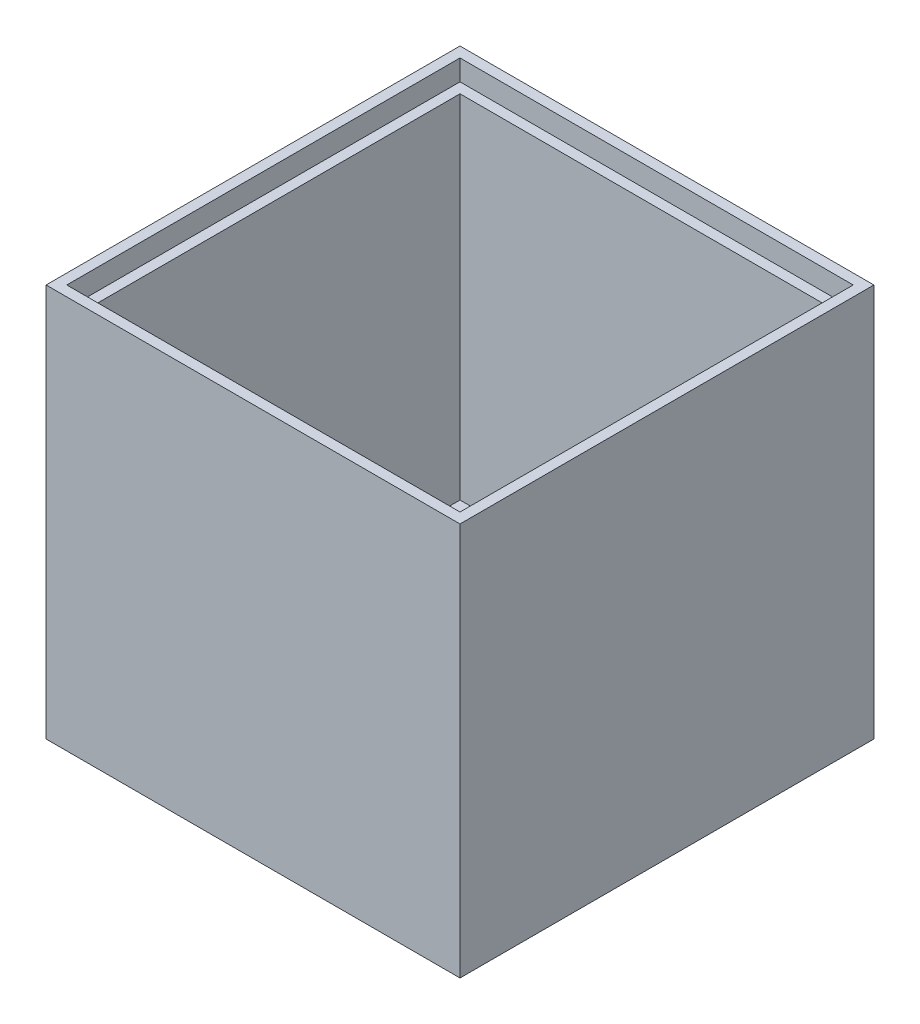
ISO-10303-21;
HEADER;
FILE_DESCRIPTION(('STEP AP214'),'2;1');
FILE_NAME('part.step','',(''),(''),'','','');
FILE_SCHEMA(('AUTOMOTIVE_DESIGN { 1 0 10303 214 1 1 1 1 }'));
ENDSEC;
DATA;
#1=APPLICATION_CONTEXT('core data for automotive mechanical design processes');
#2=APPLICATION_PROTOCOL_DEFINITION('international standard','automotive_design',2000,#1);
#3=PRODUCT_CONTEXT('',#1,'mechanical');
#4=PRODUCT('Part','Part','',(#3));
#5=PRODUCT_RELATED_PRODUCT_CATEGORY('part','',(#4));
#6=PRODUCT_DEFINITION_FORMATION('','',#4);
#7=PRODUCT_DEFINITION_CONTEXT('part definition',#1,'design');
#8=PRODUCT_DEFINITION('design','',#6,#7);
#9=PRODUCT_DEFINITION_SHAPE('','',#8);
#10=(LENGTH_UNIT() NAMED_UNIT(*) SI_UNIT(.MILLI.,.METRE.));
#11=(NAMED_UNIT(*) PLANE_ANGLE_UNIT() SI_UNIT($,.RADIAN.));
#12=(NAMED_UNIT(*) SI_UNIT($,.STERADIAN.) SOLID_ANGLE_UNIT());
#13=UNCERTAINTY_MEASURE_WITH_UNIT(LENGTH_MEASURE(1.E-05),#10,'distance_accuracy_value','');
#14=(GEOMETRIC_REPRESENTATION_CONTEXT(3) GLOBAL_UNCERTAINTY_ASSIGNED_CONTEXT((#13)) GLOBAL_UNIT_ASSIGNED_CONTEXT((#10,
#11,#12)) REPRESENTATION_CONTEXT('',''));
#15=CARTESIAN_POINT('',(0.,0.,0.));
#16=DIRECTION('',(0.,0.,1.));
#17=DIRECTION('',(1.,0.,0.));
#18=AXIS2_PLACEMENT_3D('',#15,#16,#17);
#19=CARTESIAN_POINT('',(0.,48.26,0.));
#20=DIRECTION('',(1.,0.,0.));
#21=DIRECTION('',(0.,0.,-1.));
#22=AXIS2_PLACEMENT_3D('',#19,#20,#21);
#23=PLANE('',#22);
#24=DIRECTION('',(0.,0.,1.));
#25=VECTOR('',#24,1.);
#26=CARTESIAN_POINT('',(0.,0.,0.));
#27=LINE('',#26,#25);
#28=CARTESIAN_POINT('',(0.,0.,-50.8));
#29=VERTEX_POINT('',#28);
#30=CARTESIAN_POINT('',(0.,0.,0.));
#31=VERTEX_POINT('',#30);
#32=EDGE_CURVE('E206',#29,#31,#27,.T.);
#33=ORIENTED_EDGE('',*,*,#32,.T.);
#34=DIRECTION('',(0.,-1.,0.));
#35=VECTOR('',#34,1.);
#36=CARTESIAN_POINT('',(0.,48.26,0.));
#37=LINE('',#36,#35);
#38=CARTESIAN_POINT('',(0.,48.26,0.));
#39=VERTEX_POINT('',#38);
#40=EDGE_CURVE('E47',#39,#31,#37,.T.);
#41=ORIENTED_EDGE('',*,*,#40,.F.);
#42=DIRECTION('',(0.,0.,1.));
#43=VECTOR('',#42,1.);
#44=CARTESIAN_POINT('',(0.,48.26,0.));
#45=LINE('',#44,#43);
#46=CARTESIAN_POINT('',(0.,48.26,-50.8));
#47=VERTEX_POINT('',#46);
#48=EDGE_CURVE('E218',#47,#39,#45,.T.);
#49=ORIENTED_EDGE('',*,*,#48,.F.);
#50=DIRECTION('',(0.,-1.,0.));
#51=VECTOR('',#50,1.);
#52=CARTESIAN_POINT('',(0.,48.26,-50.8));
#53=LINE('',#52,#51);
#54=EDGE_CURVE('E232',#47,#29,#53,.T.);
#55=ORIENTED_EDGE('',*,*,#54,.T.);
#56=EDGE_LOOP('',(#33,#41,#49,#55));
#57=FACE_BOUND('',#56,.T.);
#58=ADVANCED_FACE('F39',(#57),#23,.F.);
#59=CARTESIAN_POINT('',(0.,48.26,0.));
#60=DIRECTION('',(0.,0.,-1.));
#61=DIRECTION('',(-1.,0.,0.));
#62=AXIS2_PLACEMENT_3D('',#59,#60,#61);
#63=PLANE('',#62);
#64=DIRECTION('',(1.,0.,0.));
#65=VECTOR('',#64,1.);
#66=CARTESIAN_POINT('',(0.,0.,0.));
#67=LINE('',#66,#65);
#68=CARTESIAN_POINT('',(50.8,0.,0.));
#69=VERTEX_POINT('',#68);
#70=EDGE_CURVE('E236',#31,#69,#67,.T.);
#71=ORIENTED_EDGE('',*,*,#70,.T.);
#72=DIRECTION('',(0.,-1.,0.));
#73=VECTOR('',#72,1.);
#74=CARTESIAN_POINT('',(50.8,48.26,0.));
#75=LINE('',#74,#73);
#76=CARTESIAN_POINT('',(50.8,48.26,0.));
#77=VERTEX_POINT('',#76);
#78=EDGE_CURVE('E251',#77,#69,#75,.T.);
#79=ORIENTED_EDGE('',*,*,#78,.F.);
#80=DIRECTION('',(1.,0.,0.));
#81=VECTOR('',#80,1.);
#82=CARTESIAN_POINT('',(0.,48.26,0.));
#83=LINE('',#82,#81);
#84=EDGE_CURVE('E222',#39,#77,#83,.T.);
#85=ORIENTED_EDGE('',*,*,#84,.F.);
#86=ORIENTED_EDGE('',*,*,#40,.T.);
#87=EDGE_LOOP('',(#71,#79,#85,#86));
#88=FACE_BOUND('',#87,.T.);
#89=ADVANCED_FACE('F258',(#88),#63,.F.);
#90=CARTESIAN_POINT('',(50.8,48.26,0.));
#91=DIRECTION('',(-1.,0.,0.));
#92=DIRECTION('',(0.,0.,1.));
#93=AXIS2_PLACEMENT_3D('',#90,#91,#92);
#94=PLANE('',#93);
#95=DIRECTION('',(0.,0.,-1.));
#96=VECTOR('',#95,1.);
#97=CARTESIAN_POINT('',(50.8,0.,0.));
#98=LINE('',#97,#96);
#99=CARTESIAN_POINT('',(50.8,0.,-50.8));
#100=VERTEX_POINT('',#99);
#101=EDGE_CURVE('E239',#69,#100,#98,.T.);
#102=ORIENTED_EDGE('',*,*,#101,.T.);
#103=DIRECTION('',(0.,-1.,0.));
#104=VECTOR('',#103,1.);
#105=CARTESIAN_POINT('',(50.8,48.26,-50.8));
#106=LINE('',#105,#104);
#107=CARTESIAN_POINT('',(50.8,48.26,-50.8));
#108=VERTEX_POINT('',#107);
#109=EDGE_CURVE('E247',#108,#100,#106,.T.);
#110=ORIENTED_EDGE('',*,*,#109,.F.);
#111=DIRECTION('',(0.,0.,-1.));
#112=VECTOR('',#111,1.);
#113=CARTESIAN_POINT('',(50.8,48.26,0.));
#114=LINE('',#113,#112);
#115=EDGE_CURVE('E226',#77,#108,#114,.T.);
#116=ORIENTED_EDGE('',*,*,#115,.F.);
#117=ORIENTED_EDGE('',*,*,#78,.T.);
#118=EDGE_LOOP('',(#102,#110,#116,#117));
#119=FACE_BOUND('',#118,.T.);
#120=ADVANCED_FACE('F270',(#119),#94,.F.);
#121=CARTESIAN_POINT('',(0.,48.26,-50.8));
#122=DIRECTION('',(0.,0.,1.));
#123=DIRECTION('',(1.,0.,0.));
#124=AXIS2_PLACEMENT_3D('',#121,#122,#123);
#125=PLANE('',#124);
#126=DIRECTION('',(-1.,0.,0.));
#127=VECTOR('',#126,1.);
#128=CARTESIAN_POINT('',(0.,0.,-50.8));
#129=LINE('',#128,#127);
#130=EDGE_CURVE('E223',#100,#29,#129,.T.);
#131=ORIENTED_EDGE('',*,*,#130,.T.);
#132=ORIENTED_EDGE('',*,*,#54,.F.);
#133=DIRECTION('',(-1.,0.,0.));
#134=VECTOR('',#133,1.);
#135=CARTESIAN_POINT('',(0.,48.26,-50.8));
#136=LINE('',#135,#134);
#137=EDGE_CURVE('E229',#108,#47,#136,.T.);
#138=ORIENTED_EDGE('',*,*,#137,.F.);
#139=ORIENTED_EDGE('',*,*,#109,.T.);
#140=EDGE_LOOP('',(#131,#132,#138,#139));
#141=FACE_BOUND('',#140,.T.);
#142=ADVANCED_FACE('F274',(#141),#125,.F.);
#143=CARTESIAN_POINT('',(0.,48.26,0.));
#144=DIRECTION('',(0.,-1.,0.));
#145=DIRECTION('',(0.,0.,-1.));
#146=AXIS2_PLACEMENT_3D('',#143,#144,#145);
#147=PLANE('',#146);
#148=DIRECTION('',(1.,0.,0.));
#149=VECTOR('',#148,1.);
#150=CARTESIAN_POINT('',(1.27,48.26,-1.27));
#151=LINE('',#150,#149);
#152=CARTESIAN_POINT('',(1.27,48.26,-1.27));
#153=VERTEX_POINT('',#152);
#154=CARTESIAN_POINT('',(49.53,48.26,-1.27));
#155=VERTEX_POINT('',#154);
#156=EDGE_CURVE('E163',#153,#155,#151,.T.);
#157=ORIENTED_EDGE('',*,*,#156,.F.);
#158=DIRECTION('',(0.,0.,1.));
#159=VECTOR('',#158,1.);
#160=CARTESIAN_POINT('',(1.27,48.26,-49.53));
#161=LINE('',#160,#159);
#162=CARTESIAN_POINT('',(1.27,48.26,-49.53));
#163=VERTEX_POINT('',#162);
#164=EDGE_CURVE('E54',#163,#153,#161,.T.);
#165=ORIENTED_EDGE('',*,*,#164,.F.);
#166=DIRECTION('',(-1.,0.,0.));
#167=VECTOR('',#166,1.);
#168=CARTESIAN_POINT('',(1.27,48.26,-49.53));
#169=LINE('',#168,#167);
#170=CARTESIAN_POINT('',(49.53,48.26,-49.53));
#171=VERTEX_POINT('',#170);
#172=EDGE_CURVE('E150',#171,#163,#169,.T.);
#173=ORIENTED_EDGE('',*,*,#172,.F.);
#174=DIRECTION('',(0.,0.,-1.));
#175=VECTOR('',#174,1.);
#176=CARTESIAN_POINT('',(49.53,48.26,-49.53));
#177=LINE('',#176,#175);
#178=EDGE_CURVE('E154',#155,#171,#177,.T.);
#179=ORIENTED_EDGE('',*,*,#178,.F.);
#180=EDGE_LOOP('',(#157,#165,#173,#179));
#181=FACE_BOUND('',#180,.T.);
#182=ORIENTED_EDGE('',*,*,#48,.T.);
#183=ORIENTED_EDGE('',*,*,#84,.T.);
#184=ORIENTED_EDGE('',*,*,#115,.T.);
#185=ORIENTED_EDGE('',*,*,#137,.T.);
#186=EDGE_LOOP('',(#182,#183,#184,#185));
#187=FACE_BOUND('',#186,.T.);
#188=ADVANCED_FACE('F276',(#181,#187),#147,.F.);
#189=CARTESIAN_POINT('',(0.,0.,0.));
#190=DIRECTION('',(0.,-1.,0.));
#191=DIRECTION('',(0.,0.,-1.));
#192=AXIS2_PLACEMENT_3D('',#189,#190,#191);
#193=PLANE('',#192);
#194=ORIENTED_EDGE('',*,*,#32,.F.);
#195=ORIENTED_EDGE('',*,*,#130,.F.);
#196=ORIENTED_EDGE('',*,*,#101,.F.);
#197=ORIENTED_EDGE('',*,*,#70,.F.);
#198=EDGE_LOOP('',(#194,#195,#196,#197));
#199=FACE_BOUND('',#198,.T.);
#200=ADVANCED_FACE('F266',(#199),#193,.T.);
#201=CARTESIAN_POINT('',(0.,45.72,0.));
#202=DIRECTION('',(0.,1.,0.));
#203=DIRECTION('',(0.,0.,1.));
#204=AXIS2_PLACEMENT_3D('',#201,#202,#203);
#205=PLANE('',#204);
#206=DIRECTION('',(0.,0.,1.));
#207=VECTOR('',#206,1.);
#208=CARTESIAN_POINT('',(1.27,45.72,-49.53));
#209=LINE('',#208,#207);
#210=CARTESIAN_POINT('',(1.27,45.72,-49.53));
#211=VERTEX_POINT('',#210);
#212=CARTESIAN_POINT('',(1.27,45.72,-1.27));
#213=VERTEX_POINT('',#212);
#214=EDGE_CURVE('E129',#211,#213,#209,.T.);
#215=ORIENTED_EDGE('',*,*,#214,.T.);
#216=DIRECTION('',(1.,0.,0.));
#217=VECTOR('',#216,1.);
#218=CARTESIAN_POINT('',(1.27,45.72,-1.27));
#219=LINE('',#218,#217);
#220=CARTESIAN_POINT('',(49.53,45.72,-1.27));
#221=VERTEX_POINT('',#220);
#222=EDGE_CURVE('E139',#213,#221,#219,.T.);
#223=ORIENTED_EDGE('',*,*,#222,.T.);
#224=DIRECTION('',(0.,0.,-1.));
#225=VECTOR('',#224,1.);
#226=CARTESIAN_POINT('',(49.53,45.72,-49.53));
#227=LINE('',#226,#225);
#228=CARTESIAN_POINT('',(49.53,45.72,-49.53));
#229=VERTEX_POINT('',#228);
#230=EDGE_CURVE('E145',#221,#229,#227,.T.);
#231=ORIENTED_EDGE('',*,*,#230,.T.);
#232=DIRECTION('',(-1.,0.,0.));
#233=VECTOR('',#232,1.);
#234=CARTESIAN_POINT('',(1.27,45.72,-49.53));
#235=LINE('',#234,#233);
#236=EDGE_CURVE('E136',#229,#211,#235,.T.);
#237=ORIENTED_EDGE('',*,*,#236,.T.);
#238=EDGE_LOOP('',(#215,#223,#231,#237));
#239=FACE_BOUND('',#238,.T.);
#240=DIRECTION('',(0.,0.,1.));
#241=VECTOR('',#240,1.);
#242=CARTESIAN_POINT('',(48.26,45.72,-2.54));
#243=LINE('',#242,#241);
#244=CARTESIAN_POINT('',(48.26,45.72,-48.26));
#245=VERTEX_POINT('',#244);
#246=CARTESIAN_POINT('',(48.26,45.72,-2.54));
#247=VERTEX_POINT('',#246);
#248=EDGE_CURVE('E182',#245,#247,#243,.T.);
#249=ORIENTED_EDGE('',*,*,#248,.T.);
#250=DIRECTION('',(-1.,0.,0.));
#251=VECTOR('',#250,1.);
#252=CARTESIAN_POINT('',(48.26,45.72,-2.54));
#253=LINE('',#252,#251);
#254=CARTESIAN_POINT('',(2.54,45.72,-2.53999999999999));
#255=VERTEX_POINT('',#254);
#256=EDGE_CURVE('E179',#247,#255,#253,.T.);
#257=ORIENTED_EDGE('',*,*,#256,.T.);
#258=DIRECTION('',(0.,0.,-1.));
#259=VECTOR('',#258,1.);
#260=CARTESIAN_POINT('',(2.54,45.72,-2.53999999999999));
#261=LINE('',#260,#259);
#262=CARTESIAN_POINT('',(2.54,45.72,-48.26));
#263=VERTEX_POINT('',#262);
#264=EDGE_CURVE('E61',#255,#263,#261,.T.);
#265=ORIENTED_EDGE('',*,*,#264,.T.);
#266=DIRECTION('',(1.,0.,0.));
#267=VECTOR('',#266,1.);
#268=CARTESIAN_POINT('',(48.26,45.72,-48.26));
#269=LINE('',#268,#267);
#270=EDGE_CURVE('E11',#263,#245,#269,.T.);
#271=ORIENTED_EDGE('',*,*,#270,.T.);
#272=EDGE_LOOP('',(#249,#257,#265,#271));
#273=FACE_BOUND('',#272,.T.);
#274=ADVANCED_FACE('F147',(#239,#273),#205,.T.);
#275=CARTESIAN_POINT('',(1.27,45.72,-49.53));
#276=DIRECTION('',(-1.,0.,0.));
#277=DIRECTION('',(0.,0.,1.));
#278=AXIS2_PLACEMENT_3D('',#275,#276,#277);
#279=PLANE('',#278);
#280=ORIENTED_EDGE('',*,*,#164,.T.);
#281=DIRECTION('',(0.,1.,0.));
#282=VECTOR('',#281,1.);
#283=CARTESIAN_POINT('',(1.27,45.72,-1.27));
#284=LINE('',#283,#282);
#285=EDGE_CURVE('E125',#213,#153,#284,.T.);
#286=ORIENTED_EDGE('',*,*,#285,.F.);
#287=ORIENTED_EDGE('',*,*,#214,.F.);
#288=DIRECTION('',(0.,1.,0.));
#289=VECTOR('',#288,1.);
#290=CARTESIAN_POINT('',(1.27,45.72,-49.53));
#291=LINE('',#290,#289);
#292=EDGE_CURVE('E169',#211,#163,#291,.T.);
#293=ORIENTED_EDGE('',*,*,#292,.T.);
#294=EDGE_LOOP('',(#280,#286,#287,#293));
#295=FACE_BOUND('',#294,.T.);
#296=ADVANCED_FACE('F127',(#295),#279,.F.);
#297=CARTESIAN_POINT('',(1.27,45.72,-49.53));
#298=DIRECTION('',(0.,0.,-1.));
#299=DIRECTION('',(-1.,0.,0.));
#300=AXIS2_PLACEMENT_3D('',#297,#298,#299);
#301=PLANE('',#300);
#302=ORIENTED_EDGE('',*,*,#172,.T.);
#303=ORIENTED_EDGE('',*,*,#292,.F.);
#304=ORIENTED_EDGE('',*,*,#236,.F.);
#305=DIRECTION('',(0.,1.,0.));
#306=VECTOR('',#305,1.);
#307=CARTESIAN_POINT('',(49.53,45.72,-49.53));
#308=LINE('',#307,#306);
#309=EDGE_CURVE('E172',#229,#171,#308,.T.);
#310=ORIENTED_EDGE('',*,*,#309,.T.);
#311=EDGE_LOOP('',(#302,#303,#304,#310));
#312=FACE_BOUND('',#311,.T.);
#313=ADVANCED_FACE('F343',(#312),#301,.F.);
#314=CARTESIAN_POINT('',(49.53,45.72,-49.53));
#315=DIRECTION('',(1.,0.,0.));
#316=DIRECTION('',(0.,0.,-1.));
#317=AXIS2_PLACEMENT_3D('',#314,#315,#316);
#318=PLANE('',#317);
#319=ORIENTED_EDGE('',*,*,#178,.T.);
#320=ORIENTED_EDGE('',*,*,#309,.F.);
#321=ORIENTED_EDGE('',*,*,#230,.F.);
#322=DIRECTION('',(0.,1.,0.));
#323=VECTOR('',#322,1.);
#324=CARTESIAN_POINT('',(49.53,45.72,-1.27));
#325=LINE('',#324,#323);
#326=EDGE_CURVE('E135',#221,#155,#325,.T.);
#327=ORIENTED_EDGE('',*,*,#326,.T.);
#328=EDGE_LOOP('',(#319,#320,#321,#327));
#329=FACE_BOUND('',#328,.T.);
#330=ADVANCED_FACE('F352',(#329),#318,.F.);
#331=CARTESIAN_POINT('',(1.27,45.72,-1.27));
#332=DIRECTION('',(0.,0.,1.));
#333=DIRECTION('',(1.,0.,0.));
#334=AXIS2_PLACEMENT_3D('',#331,#332,#333);
#335=PLANE('',#334);
#336=ORIENTED_EDGE('',*,*,#156,.T.);
#337=ORIENTED_EDGE('',*,*,#326,.F.);
#338=ORIENTED_EDGE('',*,*,#222,.F.);
#339=ORIENTED_EDGE('',*,*,#285,.T.);
#340=EDGE_LOOP('',(#336,#337,#338,#339));
#341=FACE_BOUND('',#340,.T.);
#342=ADVANCED_FACE('F140',(#341),#335,.F.);
#343=CARTESIAN_POINT('',(0.,2.54,0.));
#344=DIRECTION('',(0.,1.,0.));
#345=DIRECTION('',(0.,0.,1.));
#346=AXIS2_PLACEMENT_3D('',#343,#344,#345);
#347=PLANE('',#346);
#348=DIRECTION('',(0.,0.,-1.));
#349=VECTOR('',#348,1.);
#350=CARTESIAN_POINT('',(48.26,2.54,-2.54));
#351=LINE('',#350,#349);
#352=CARTESIAN_POINT('',(48.26,2.54,-2.54));
#353=VERTEX_POINT('',#352);
#354=CARTESIAN_POINT('',(48.26,2.54,-48.26));
#355=VERTEX_POINT('',#354);
#356=EDGE_CURVE('E185',#353,#355,#351,.T.);
#357=ORIENTED_EDGE('',*,*,#356,.T.);
#358=DIRECTION('',(-1.,0.,0.));
#359=VECTOR('',#358,1.);
#360=CARTESIAN_POINT('',(48.26,2.54,-48.26));
#361=LINE('',#360,#359);
#362=CARTESIAN_POINT('',(2.54,2.54,-48.26));
#363=VERTEX_POINT('',#362);
#364=EDGE_CURVE('E189',#355,#363,#361,.T.);
#365=ORIENTED_EDGE('',*,*,#364,.T.);
#366=DIRECTION('',(0.,0.,1.));
#367=VECTOR('',#366,1.);
#368=CARTESIAN_POINT('',(2.54,2.54,-2.53999999999999));
#369=LINE('',#368,#367);
#370=CARTESIAN_POINT('',(2.54,2.54,-2.53999999999999));
#371=VERTEX_POINT('',#370);
#372=EDGE_CURVE('E193',#363,#371,#369,.T.);
#373=ORIENTED_EDGE('',*,*,#372,.T.);
#374=DIRECTION('',(1.,0.,0.));
#375=VECTOR('',#374,1.);
#376=CARTESIAN_POINT('',(48.26,2.54,-2.54));
#377=LINE('',#376,#375);
#378=EDGE_CURVE('E197',#371,#353,#377,.T.);
#379=ORIENTED_EDGE('',*,*,#378,.T.);
#380=EDGE_LOOP('',(#357,#365,#373,#379));
#381=FACE_BOUND('',#380,.T.);
#382=ADVANCED_FACE('F315',(#381),#347,.T.);
#383=CARTESIAN_POINT('',(48.26,2.54,-48.26));
#384=DIRECTION('',(0.,0.,-1.));
#385=DIRECTION('',(-1.,0.,0.));
#386=AXIS2_PLACEMENT_3D('',#383,#384,#385);
#387=PLANE('',#386);
#388=ORIENTED_EDGE('',*,*,#270,.F.);
#389=DIRECTION('',(0.,1.,0.));
#390=VECTOR('',#389,1.);
#391=CARTESIAN_POINT('',(2.54,2.54,-48.26));
#392=LINE('',#391,#390);
#393=EDGE_CURVE('E211',#363,#263,#392,.T.);
#394=ORIENTED_EDGE('',*,*,#393,.F.);
#395=ORIENTED_EDGE('',*,*,#364,.F.);
#396=DIRECTION('',(0.,1.,0.));
#397=VECTOR('',#396,1.);
#398=CARTESIAN_POINT('',(48.26,2.54,-48.26));
#399=LINE('',#398,#397);
#400=EDGE_CURVE('E201',#355,#245,#399,.T.);
#401=ORIENTED_EDGE('',*,*,#400,.T.);
#402=EDGE_LOOP('',(#388,#394,#395,#401));
#403=FACE_BOUND('',#402,.T.);
#404=ADVANCED_FACE('F318',(#403),#387,.F.);
#405=CARTESIAN_POINT('',(2.54,2.54,-2.53999999999999));
#406=DIRECTION('',(-1.,0.,0.));
#407=DIRECTION('',(0.,0.,1.));
#408=AXIS2_PLACEMENT_3D('',#405,#406,#407);
#409=PLANE('',#408);
#410=ORIENTED_EDGE('',*,*,#264,.F.);
#411=DIRECTION('',(0.,1.,0.));
#412=VECTOR('',#411,1.);
#413=CARTESIAN_POINT('',(2.54,2.54,-2.53999999999999));
#414=LINE('',#413,#412);
#415=EDGE_CURVE('E207',#371,#255,#414,.T.);
#416=ORIENTED_EDGE('',*,*,#415,.F.);
#417=ORIENTED_EDGE('',*,*,#372,.F.);
#418=ORIENTED_EDGE('',*,*,#393,.T.);
#419=EDGE_LOOP('',(#410,#416,#417,#418));
#420=FACE_BOUND('',#419,.T.);
#421=ADVANCED_FACE('F376',(#420),#409,.F.);
#422=CARTESIAN_POINT('',(48.26,2.54,-2.54));
#423=DIRECTION('',(0.,0.,1.));
#424=DIRECTION('',(1.,0.,0.));
#425=AXIS2_PLACEMENT_3D('',#422,#423,#424);
#426=PLANE('',#425);
#427=ORIENTED_EDGE('',*,*,#256,.F.);
#428=DIRECTION('',(0.,1.,0.));
#429=VECTOR('',#428,1.);
#430=CARTESIAN_POINT('',(48.26,2.54,-2.54));
#431=LINE('',#430,#429);
#432=EDGE_CURVE('E202',#353,#247,#431,.T.);
#433=ORIENTED_EDGE('',*,*,#432,.F.);
#434=ORIENTED_EDGE('',*,*,#378,.F.);
#435=ORIENTED_EDGE('',*,*,#415,.T.);
#436=EDGE_LOOP('',(#427,#433,#434,#435));
#437=FACE_BOUND('',#436,.T.);
#438=ADVANCED_FACE('F386',(#437),#426,.F.);
#439=CARTESIAN_POINT('',(48.26,2.54,-2.54));
#440=DIRECTION('',(1.,0.,0.));
#441=DIRECTION('',(0.,0.,-1.));
#442=AXIS2_PLACEMENT_3D('',#439,#440,#441);
#443=PLANE('',#442);
#444=ORIENTED_EDGE('',*,*,#248,.F.);
#445=ORIENTED_EDGE('',*,*,#400,.F.);
#446=ORIENTED_EDGE('',*,*,#356,.F.);
#447=ORIENTED_EDGE('',*,*,#432,.T.);
#448=EDGE_LOOP('',(#444,#445,#446,#447));
#449=FACE_BOUND('',#448,.T.);
#450=ADVANCED_FACE('F396',(#449),#443,.F.);
#451=CLOSED_SHELL('',(#58,#89,#120,#142,#188,#200,#274,#296,#313,#330,#342,#382,#404,#421,#438,#450));
#452=MANIFOLD_SOLID_BREP('B2',#451);
#453=ADVANCED_BREP_SHAPE_REPRESENTATION('',(#18,#452),#14);
#454=SHAPE_DEFINITION_REPRESENTATION(#9,#453);
ENDSEC;
END-ISO-10303-21;
